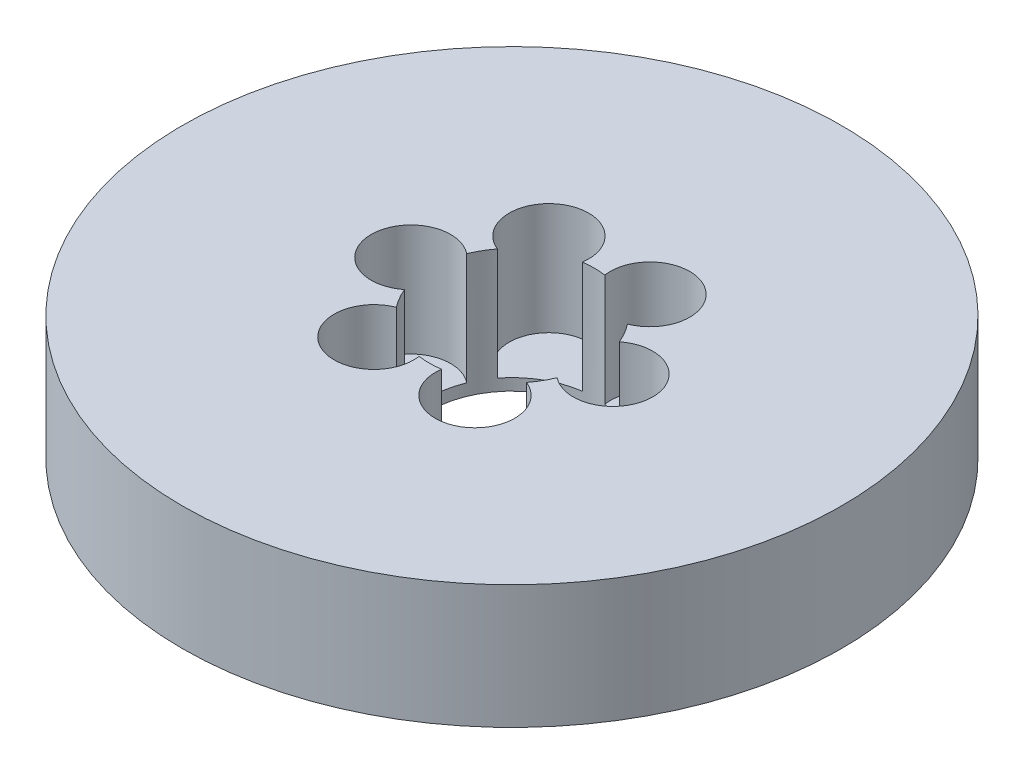
ISO-10303-21;
HEADER;
FILE_DESCRIPTION(('STEP AP214'),'2;1');
FILE_NAME('part.step','',(''),(''),'','','');
FILE_SCHEMA(('AUTOMOTIVE_DESIGN { 1 0 10303 214 1 1 1 1 }'));
ENDSEC;
DATA;
#1=APPLICATION_CONTEXT('core data for automotive mechanical design processes');
#2=APPLICATION_PROTOCOL_DEFINITION('international standard','automotive_design',2000,#1);
#3=PRODUCT_CONTEXT('',#1,'mechanical');
#4=PRODUCT('Part','Part','',(#3));
#5=PRODUCT_RELATED_PRODUCT_CATEGORY('part','',(#4));
#6=PRODUCT_DEFINITION_FORMATION('','',#4);
#7=PRODUCT_DEFINITION_CONTEXT('part definition',#1,'design');
#8=PRODUCT_DEFINITION('design','',#6,#7);
#9=PRODUCT_DEFINITION_SHAPE('','',#8);
#10=(LENGTH_UNIT() NAMED_UNIT(*) SI_UNIT(.MILLI.,.METRE.));
#11=(NAMED_UNIT(*) PLANE_ANGLE_UNIT() SI_UNIT($,.RADIAN.));
#12=(NAMED_UNIT(*) SI_UNIT($,.STERADIAN.) SOLID_ANGLE_UNIT());
#13=UNCERTAINTY_MEASURE_WITH_UNIT(LENGTH_MEASURE(1.E-05),#10,'distance_accuracy_value','');
#14=(GEOMETRIC_REPRESENTATION_CONTEXT(3) GLOBAL_UNCERTAINTY_ASSIGNED_CONTEXT((#13)) GLOBAL_UNIT_ASSIGNED_CONTEXT((#10,
#11,#12)) REPRESENTATION_CONTEXT('',''));
#15=CARTESIAN_POINT('',(0.,0.,0.));
#16=DIRECTION('',(0.,0.,1.));
#17=DIRECTION('',(1.,0.,0.));
#18=AXIS2_PLACEMENT_3D('',#15,#16,#17);
#19=CARTESIAN_POINT('',(0.,30.,0.));
#20=DIRECTION('',(0.,-1.,0.));
#21=DIRECTION('',(0.,0.,-1.));
#22=AXIS2_PLACEMENT_3D('',#19,#20,#21);
#23=CYLINDRICAL_SURFACE('',#22,80.);
#24=CARTESIAN_POINT('',(0.,30.,0.));
#25=DIRECTION('',(0.,1.,0.));
#26=DIRECTION('',(0.,0.,1.));
#27=AXIS2_PLACEMENT_3D('',#24,#25,#26);
#28=CIRCLE('',#27,80.);
#29=CARTESIAN_POINT('',(0.,30.,80.));
#30=VERTEX_POINT('',#29);
#31=EDGE_CURVE('E171',#30,#30,#28,.T.);
#32=ORIENTED_EDGE('',*,*,#31,.F.);
#33=EDGE_LOOP('',(#32));
#34=FACE_BOUND('',#33,.T.);
#35=CARTESIAN_POINT('',(0.,0.,0.));
#36=DIRECTION('',(0.,1.,0.));
#37=DIRECTION('',(0.,0.,1.));
#38=AXIS2_PLACEMENT_3D('',#35,#36,#37);
#39=CIRCLE('',#38,80.);
#40=CARTESIAN_POINT('',(0.,0.,80.));
#41=VERTEX_POINT('',#40);
#42=EDGE_CURVE('E157',#41,#41,#39,.T.);
#43=ORIENTED_EDGE('',*,*,#42,.T.);
#44=EDGE_LOOP('',(#43));
#45=FACE_BOUND('',#44,.T.);
#46=ADVANCED_FACE('F39',(#34,#45),#23,.T.);
#47=CARTESIAN_POINT('',(0.,30.,0.));
#48=DIRECTION('',(0.,1.,0.));
#49=DIRECTION('',(0.,0.,1.));
#50=AXIS2_PLACEMENT_3D('',#47,#48,#49);
#51=PLANE('',#50);
#52=CARTESIAN_POINT('',(-12.2628299238324,30.,-21.2398444726531));
#53=DIRECTION('',(0.,1.,0.));
#54=DIRECTION('',(-0.866025403784433,0.,0.50000000000001));
#55=AXIS2_PLACEMENT_3D('',#52,#53,#54);
#56=CIRCLE('',#55,9.64634296790213);
#57=CARTESIAN_POINT('',(-2.72247164071736,30.,-19.8138372902749));
#58=VERTEX_POINT('',#57);
#59=CARTESIAN_POINT('',(-15.7980506194711,30.,-12.264648247081));
#60=VERTEX_POINT('',#59);
#61=EDGE_CURVE('E214',#58,#60,#56,.T.);
#62=ORIENTED_EDGE('',*,*,#61,.F.);
#63=CARTESIAN_POINT('',(0.,30.,0.));
#64=DIRECTION('',(0.,1.,0.));
#65=DIRECTION('',(0.,0.,1.));
#66=AXIS2_PLACEMENT_3D('',#63,#64,#65);
#67=CIRCLE('',#66,20.);
#68=CARTESIAN_POINT('',(2.72247164071694,30.,-19.813837290275));
#69=VERTEX_POINT('',#68);
#70=EDGE_CURVE('E272',#69,#58,#67,.T.);
#71=ORIENTED_EDGE('',*,*,#70,.F.);
#72=CARTESIAN_POINT('',(12.2628299238319,30.,-21.2398444726533));
#73=DIRECTION('',(0.,1.,0.));
#74=DIRECTION('',(-0.866025403784443,0.,-0.499999999999992));
#75=AXIS2_PLACEMENT_3D('',#72,#73,#74);
#76=CIRCLE('',#75,9.64634296790213);
#77=CARTESIAN_POINT('',(15.7980506194709,30.,-12.2646482470814));
#78=VERTEX_POINT('',#77);
#79=EDGE_CURVE('E285',#78,#69,#76,.T.);
#80=ORIENTED_EDGE('',*,*,#79,.F.);
#81=CARTESIAN_POINT('',(18.5205222601881,30.,-7.54918904319375));
#82=VERTEX_POINT('',#81);
#83=EDGE_CURVE('E165',#82,#78,#67,.T.);
#84=ORIENTED_EDGE('',*,*,#83,.F.);
#85=CARTESIAN_POINT('',(24.5256598476642,30.,0.));
#86=DIRECTION('',(0.,1.,0.));
#87=DIRECTION('',(0.,0.,-1.));
#88=AXIS2_PLACEMENT_3D('',#85,#86,#87);
#89=CIRCLE('',#88,9.64634296790213);
#90=CARTESIAN_POINT('',(18.5205222601881,30.,7.54918904319375));
#91=VERTEX_POINT('',#90);
#92=EDGE_CURVE('E281',#91,#82,#89,.T.);
#93=ORIENTED_EDGE('',*,*,#92,.F.);
#94=CARTESIAN_POINT('',(15.798050619471,30.,12.2646482470811));
#95=VERTEX_POINT('',#94);
#96=EDGE_CURVE('E160',#95,#91,#67,.T.);
#97=ORIENTED_EDGE('',*,*,#96,.F.);
#98=CARTESIAN_POINT('',(12.2628299238322,30.,21.2398444726531));
#99=DIRECTION('',(0.,1.,0.));
#100=DIRECTION('',(0.866025403784436,0.,-0.500000000000004));
#101=AXIS2_PLACEMENT_3D('',#98,#99,#100);
#102=CIRCLE('',#101,9.64634296790213);
#103=CARTESIAN_POINT('',(2.72247164071722,30.,19.813837290275));
#104=VERTEX_POINT('',#103);
#105=EDGE_CURVE('E154',#104,#95,#102,.T.);
#106=ORIENTED_EDGE('',*,*,#105,.F.);
#107=CARTESIAN_POINT('',(-2.72247164071708,30.,19.813837290275));
#108=VERTEX_POINT('',#107);
#109=EDGE_CURVE('E150',#108,#104,#67,.T.);
#110=ORIENTED_EDGE('',*,*,#109,.F.);
#111=CARTESIAN_POINT('',(-12.2628299238321,30.,21.2398444726532));
#112=DIRECTION('',(0.,1.,0.));
#113=DIRECTION('',(0.86602540378444,0.,0.499999999999998));
#114=AXIS2_PLACEMENT_3D('',#111,#112,#113);
#115=CIRCLE('',#114,9.64634296790213);
#116=CARTESIAN_POINT('',(-15.798050619471,30.,12.2646482470813));
#117=VERTEX_POINT('',#116);
#118=EDGE_CURVE('E127',#117,#108,#115,.T.);
#119=ORIENTED_EDGE('',*,*,#118,.F.);
#120=CARTESIAN_POINT('',(-18.5205222601881,30.,7.54918904319375));
#121=VERTEX_POINT('',#120);
#122=EDGE_CURVE('E156',#121,#117,#67,.T.);
#123=ORIENTED_EDGE('',*,*,#122,.F.);
#124=CARTESIAN_POINT('',(-24.5256598476642,30.,0.));
#125=DIRECTION('',(0.,1.,0.));
#126=DIRECTION('',(0.,0.,1.));
#127=AXIS2_PLACEMENT_3D('',#124,#125,#126);
#128=CIRCLE('',#127,9.64634296790213);
#129=CARTESIAN_POINT('',(-18.5205222601881,30.,-7.54918904319375));
#130=VERTEX_POINT('',#129);
#131=EDGE_CURVE('E164',#130,#121,#128,.T.);
#132=ORIENTED_EDGE('',*,*,#131,.F.);
#133=EDGE_CURVE('E159',#60,#130,#67,.T.);
#134=ORIENTED_EDGE('',*,*,#133,.F.);
#135=EDGE_LOOP('',(#62,#71,#80,#84,#93,#97,#106,#110,#119,#123,#132,#134));
#136=FACE_BOUND('',#135,.T.);
#137=ORIENTED_EDGE('',*,*,#31,.T.);
#138=EDGE_LOOP('',(#137));
#139=FACE_BOUND('',#138,.T.);
#140=ADVANCED_FACE('F155',(#136,#139),#51,.T.);
#141=CARTESIAN_POINT('',(0.,0.,0.));
#142=DIRECTION('',(0.,1.,0.));
#143=DIRECTION('',(0.,0.,1.));
#144=AXIS2_PLACEMENT_3D('',#141,#142,#143);
#145=PLANE('',#144);
#146=CARTESIAN_POINT('',(0.,0.,0.));
#147=DIRECTION('',(0.,1.,0.));
#148=DIRECTION('',(0.,0.,1.));
#149=AXIS2_PLACEMENT_3D('',#146,#147,#148);
#150=CIRCLE('',#149,20.);
#151=CARTESIAN_POINT('',(0.,0.,20.));
#152=VERTEX_POINT('',#151);
#153=EDGE_CURVE('E170',#152,#152,#150,.T.);
#154=ORIENTED_EDGE('',*,*,#153,.T.);
#155=EDGE_LOOP('',(#154));
#156=FACE_BOUND('',#155,.T.);
#157=ORIENTED_EDGE('',*,*,#42,.F.);
#158=EDGE_LOOP('',(#157));
#159=FACE_BOUND('',#158,.T.);
#160=ADVANCED_FACE('F232',(#156,#159),#145,.F.);
#161=CARTESIAN_POINT('',(0.,30.,0.));
#162=DIRECTION('',(0.,-1.,0.));
#163=DIRECTION('',(0.,0.,-1.));
#164=AXIS2_PLACEMENT_3D('',#161,#162,#163);
#165=CYLINDRICAL_SURFACE('',#164,20.);
#166=DIRECTION('',(0.,1.,0.));
#167=VECTOR('',#166,1.);
#168=CARTESIAN_POINT('',(-2.72247164071736,16.4276454205517,-19.8138372902749));
#169=LINE('',#168,#167);
#170=CARTESIAN_POINT('',(-2.72247164071736,2.85529084110336,-19.8138372902749));
#171=VERTEX_POINT('',#170);
#172=EDGE_CURVE('E11',#171,#58,#169,.T.);
#173=ORIENTED_EDGE('',*,*,#172,.F.);
#174=CARTESIAN_POINT('',(0.,2.85529084110336,0.));
#175=DIRECTION('',(0.,1.,0.));
#176=DIRECTION('',(0.,0.,1.));
#177=AXIS2_PLACEMENT_3D('',#174,#175,#176);
#178=CIRCLE('',#177,20.);
#179=CARTESIAN_POINT('',(-15.7980506194711,2.85529084110336,-12.264648247081));
#180=VERTEX_POINT('',#179);
#181=EDGE_CURVE('E209',#171,#180,#178,.T.);
#182=ORIENTED_EDGE('',*,*,#181,.T.);
#183=DIRECTION('',(0.,1.,0.));
#184=VECTOR('',#183,1.);
#185=CARTESIAN_POINT('',(-15.7980506194711,16.4276454205517,-12.264648247081));
#186=LINE('',#185,#184);
#187=EDGE_CURVE('E46',#60,#180,#186,.F.);
#188=ORIENTED_EDGE('',*,*,#187,.F.);
#189=ORIENTED_EDGE('',*,*,#133,.T.);
#190=DIRECTION('',(0.,1.,0.));
#191=VECTOR('',#190,1.);
#192=CARTESIAN_POINT('',(-18.5205222601881,16.4276454205517,-7.54918904319375));
#193=LINE('',#192,#191);
#194=CARTESIAN_POINT('',(-18.5205222601881,2.85529084110336,-7.54918904319375));
#195=VERTEX_POINT('',#194);
#196=EDGE_CURVE('E185',#195,#130,#193,.T.);
#197=ORIENTED_EDGE('',*,*,#196,.F.);
#198=CARTESIAN_POINT('',(0.,2.85529084110336,0.));
#199=DIRECTION('',(0.,1.,0.));
#200=DIRECTION('',(0.,0.,1.));
#201=AXIS2_PLACEMENT_3D('',#198,#199,#200);
#202=CIRCLE('',#201,20.);
#203=CARTESIAN_POINT('',(-18.5205222601881,2.85529084110336,7.54918904319375));
#204=VERTEX_POINT('',#203);
#205=EDGE_CURVE('E173',#195,#204,#202,.T.);
#206=ORIENTED_EDGE('',*,*,#205,.T.);
#207=DIRECTION('',(0.,1.,0.));
#208=VECTOR('',#207,1.);
#209=CARTESIAN_POINT('',(-18.5205222601881,16.4276454205517,7.54918904319375));
#210=LINE('',#209,#208);
#211=EDGE_CURVE('E178',#121,#204,#210,.F.);
#212=ORIENTED_EDGE('',*,*,#211,.F.);
#213=ORIENTED_EDGE('',*,*,#122,.T.);
#214=DIRECTION('',(0.,1.,0.));
#215=VECTOR('',#214,1.);
#216=CARTESIAN_POINT('',(-15.798050619471,16.4276454205517,12.2646482470813));
#217=LINE('',#216,#215);
#218=CARTESIAN_POINT('',(-15.798050619471,2.85529084110336,12.2646482470813));
#219=VERTEX_POINT('',#218);
#220=EDGE_CURVE('E132',#219,#117,#217,.T.);
#221=ORIENTED_EDGE('',*,*,#220,.F.);
#222=CARTESIAN_POINT('',(0.,2.85529084110336,0.));
#223=DIRECTION('',(0.,1.,0.));
#224=DIRECTION('',(0.,0.,1.));
#225=AXIS2_PLACEMENT_3D('',#222,#223,#224);
#226=CIRCLE('',#225,20.);
#227=CARTESIAN_POINT('',(-2.72247164071708,2.85529084110336,19.813837290275));
#228=VERTEX_POINT('',#227);
#229=EDGE_CURVE('E146',#219,#228,#226,.T.);
#230=ORIENTED_EDGE('',*,*,#229,.T.);
#231=DIRECTION('',(0.,1.,0.));
#232=VECTOR('',#231,1.);
#233=CARTESIAN_POINT('',(-2.72247164071708,16.4276454205517,19.813837290275));
#234=LINE('',#233,#232);
#235=EDGE_CURVE('E128',#108,#228,#234,.F.);
#236=ORIENTED_EDGE('',*,*,#235,.F.);
#237=ORIENTED_EDGE('',*,*,#109,.T.);
#238=DIRECTION('',(0.,1.,0.));
#239=VECTOR('',#238,1.);
#240=CARTESIAN_POINT('',(2.72247164071722,16.4276454205517,19.813837290275));
#241=LINE('',#240,#239);
#242=CARTESIAN_POINT('',(2.72247164071722,2.85529084110336,19.813837290275));
#243=VERTEX_POINT('',#242);
#244=EDGE_CURVE('E192',#243,#104,#241,.T.);
#245=ORIENTED_EDGE('',*,*,#244,.F.);
#246=CARTESIAN_POINT('',(0.,2.85529084110336,0.));
#247=DIRECTION('',(0.,1.,0.));
#248=DIRECTION('',(0.,0.,1.));
#249=AXIS2_PLACEMENT_3D('',#246,#247,#248);
#250=CIRCLE('',#249,20.);
#251=CARTESIAN_POINT('',(15.798050619471,2.85529084110336,12.2646482470811));
#252=VERTEX_POINT('',#251);
#253=EDGE_CURVE('E190',#243,#252,#250,.T.);
#254=ORIENTED_EDGE('',*,*,#253,.T.);
#255=DIRECTION('',(0.,1.,0.));
#256=VECTOR('',#255,1.);
#257=CARTESIAN_POINT('',(15.798050619471,16.4276454205517,12.2646482470811));
#258=LINE('',#257,#256);
#259=EDGE_CURVE('E189',#95,#252,#258,.F.);
#260=ORIENTED_EDGE('',*,*,#259,.F.);
#261=ORIENTED_EDGE('',*,*,#96,.T.);
#262=DIRECTION('',(0.,1.,0.));
#263=VECTOR('',#262,1.);
#264=CARTESIAN_POINT('',(18.5205222601881,16.4276454205517,7.54918904319375));
#265=LINE('',#264,#263);
#266=CARTESIAN_POINT('',(18.5205222601881,2.85529084110336,7.54918904319375));
#267=VERTEX_POINT('',#266);
#268=EDGE_CURVE('E203',#267,#91,#265,.T.);
#269=ORIENTED_EDGE('',*,*,#268,.F.);
#270=CARTESIAN_POINT('',(0.,2.85529084110336,0.));
#271=DIRECTION('',(0.,1.,0.));
#272=DIRECTION('',(0.,0.,1.));
#273=AXIS2_PLACEMENT_3D('',#270,#271,#272);
#274=CIRCLE('',#273,20.);
#275=CARTESIAN_POINT('',(18.5205222601881,2.85529084110336,-7.54918904319375));
#276=VERTEX_POINT('',#275);
#277=EDGE_CURVE('E194',#267,#276,#274,.T.);
#278=ORIENTED_EDGE('',*,*,#277,.T.);
#279=DIRECTION('',(0.,1.,0.));
#280=VECTOR('',#279,1.);
#281=CARTESIAN_POINT('',(18.5205222601881,16.4276454205517,-7.54918904319375));
#282=LINE('',#281,#280);
#283=EDGE_CURVE('E196',#82,#276,#282,.F.);
#284=ORIENTED_EDGE('',*,*,#283,.F.);
#285=ORIENTED_EDGE('',*,*,#83,.T.);
#286=DIRECTION('',(0.,1.,0.));
#287=VECTOR('',#286,1.);
#288=CARTESIAN_POINT('',(15.7980506194709,16.4276454205517,-12.2646482470814));
#289=LINE('',#288,#287);
#290=CARTESIAN_POINT('',(15.7980506194709,2.85529084110336,-12.2646482470814));
#291=VERTEX_POINT('',#290);
#292=EDGE_CURVE('E208',#291,#78,#289,.T.);
#293=ORIENTED_EDGE('',*,*,#292,.F.);
#294=CARTESIAN_POINT('',(0.,2.85529084110336,0.));
#295=DIRECTION('',(0.,1.,0.));
#296=DIRECTION('',(0.,0.,1.));
#297=AXIS2_PLACEMENT_3D('',#294,#295,#296);
#298=CIRCLE('',#297,20.);
#299=CARTESIAN_POINT('',(2.72247164071694,2.85529084110336,-19.813837290275));
#300=VERTEX_POINT('',#299);
#301=EDGE_CURVE('E201',#291,#300,#298,.T.);
#302=ORIENTED_EDGE('',*,*,#301,.T.);
#303=DIRECTION('',(0.,1.,0.));
#304=VECTOR('',#303,1.);
#305=CARTESIAN_POINT('',(2.72247164071694,16.4276454205517,-19.813837290275));
#306=LINE('',#305,#304);
#307=EDGE_CURVE('E206',#69,#300,#306,.F.);
#308=ORIENTED_EDGE('',*,*,#307,.F.);
#309=ORIENTED_EDGE('',*,*,#70,.T.);
#310=EDGE_LOOP('',(#173,#182,#188,#189,#197,#206,#212,#213,#221,#230,#236,#237,#245,#254,#260,
#261,#269,#278,#284,#285,#293,#302,#308,#309));
#311=FACE_BOUND('',#310,.T.);
#312=ORIENTED_EDGE('',*,*,#153,.F.);
#313=EDGE_LOOP('',(#312));
#314=FACE_BOUND('',#313,.T.);
#315=ADVANCED_FACE('F145',(#311,#314),#165,.F.);
#316=CARTESIAN_POINT('',(-24.5256598476642,2.85529084110336,0.));
#317=DIRECTION('',(0.,1.,0.));
#318=DIRECTION('',(0.,0.,1.));
#319=AXIS2_PLACEMENT_3D('',#316,#317,#318);
#320=CYLINDRICAL_SURFACE('',#319,9.64634296790213);
#321=ORIENTED_EDGE('',*,*,#196,.T.);
#322=ORIENTED_EDGE('',*,*,#131,.T.);
#323=ORIENTED_EDGE('',*,*,#211,.T.);
#324=CARTESIAN_POINT('',(-24.5256598476642,2.85529084110336,0.));
#325=DIRECTION('',(0.,1.,0.));
#326=DIRECTION('',(0.,0.,1.));
#327=AXIS2_PLACEMENT_3D('',#324,#325,#326);
#328=CIRCLE('',#327,9.64634296790213);
#329=EDGE_CURVE('E168',#195,#204,#328,.T.);
#330=ORIENTED_EDGE('',*,*,#329,.F.);
#331=EDGE_LOOP('',(#321,#322,#323,#330));
#332=FACE_BOUND('',#331,.T.);
#333=ADVANCED_FACE('F243',(#332),#320,.F.);
#334=CARTESIAN_POINT('',(-24.5256598476642,2.85529084110336,0.));
#335=DIRECTION('',(0.,1.,0.));
#336=DIRECTION('',(0.,0.,1.));
#337=AXIS2_PLACEMENT_3D('',#334,#335,#336);
#338=PLANE('',#337);
#339=ORIENTED_EDGE('',*,*,#329,.T.);
#340=ORIENTED_EDGE('',*,*,#205,.F.);
#341=EDGE_LOOP('',(#339,#340));
#342=FACE_BOUND('',#341,.T.);
#343=ADVANCED_FACE('F247',(#342),#338,.T.);
#344=CARTESIAN_POINT('',(-12.2628299238321,2.85529084110336,21.2398444726532));
#345=DIRECTION('',(0.,1.,0.));
#346=DIRECTION('',(0.,0.,1.));
#347=AXIS2_PLACEMENT_3D('',#344,#345,#346);
#348=CYLINDRICAL_SURFACE('',#347,9.64634296790213);
#349=ORIENTED_EDGE('',*,*,#220,.T.);
#350=ORIENTED_EDGE('',*,*,#118,.T.);
#351=ORIENTED_EDGE('',*,*,#235,.T.);
#352=CARTESIAN_POINT('',(-12.2628299238321,2.85529084110336,21.2398444726532));
#353=DIRECTION('',(0.,1.,0.));
#354=DIRECTION('',(0.86602540378444,0.,0.499999999999998));
#355=AXIS2_PLACEMENT_3D('',#352,#353,#354);
#356=CIRCLE('',#355,9.64634296790213);
#357=EDGE_CURVE('E137',#219,#228,#356,.T.);
#358=ORIENTED_EDGE('',*,*,#357,.F.);
#359=EDGE_LOOP('',(#349,#350,#351,#358));
#360=FACE_BOUND('',#359,.T.);
#361=ADVANCED_FACE('F126',(#360),#348,.F.);
#362=CARTESIAN_POINT('',(-12.2628299238321,2.85529084110336,21.2398444726532));
#363=DIRECTION('',(0.,1.,0.));
#364=DIRECTION('',(0.86602540378444,0.,0.499999999999998));
#365=AXIS2_PLACEMENT_3D('',#362,#363,#364);
#366=PLANE('',#365);
#367=ORIENTED_EDGE('',*,*,#357,.T.);
#368=ORIENTED_EDGE('',*,*,#229,.F.);
#369=EDGE_LOOP('',(#367,#368));
#370=FACE_BOUND('',#369,.T.);
#371=ADVANCED_FACE('F254',(#370),#366,.T.);
#372=CARTESIAN_POINT('',(12.2628299238322,2.85529084110336,21.2398444726531));
#373=DIRECTION('',(0.,1.,0.));
#374=DIRECTION('',(0.,0.,1.));
#375=AXIS2_PLACEMENT_3D('',#372,#373,#374);
#376=CYLINDRICAL_SURFACE('',#375,9.64634296790213);
#377=ORIENTED_EDGE('',*,*,#244,.T.);
#378=ORIENTED_EDGE('',*,*,#105,.T.);
#379=ORIENTED_EDGE('',*,*,#259,.T.);
#380=CARTESIAN_POINT('',(12.2628299238322,2.85529084110336,21.2398444726531));
#381=DIRECTION('',(0.,1.,0.));
#382=DIRECTION('',(0.866025403784436,0.,-0.500000000000004));
#383=AXIS2_PLACEMENT_3D('',#380,#381,#382);
#384=CIRCLE('',#383,9.64634296790213);
#385=EDGE_CURVE('E138',#243,#252,#384,.T.);
#386=ORIENTED_EDGE('',*,*,#385,.F.);
#387=EDGE_LOOP('',(#377,#378,#379,#386));
#388=FACE_BOUND('',#387,.T.);
#389=ADVANCED_FACE('F260',(#388),#376,.F.);
#390=CARTESIAN_POINT('',(12.2628299238322,2.85529084110336,21.2398444726531));
#391=DIRECTION('',(0.,1.,0.));
#392=DIRECTION('',(0.866025403784436,0.,-0.500000000000004));
#393=AXIS2_PLACEMENT_3D('',#390,#391,#392);
#394=PLANE('',#393);
#395=ORIENTED_EDGE('',*,*,#385,.T.);
#396=ORIENTED_EDGE('',*,*,#253,.F.);
#397=EDGE_LOOP('',(#395,#396));
#398=FACE_BOUND('',#397,.T.);
#399=ADVANCED_FACE('F265',(#398),#394,.T.);
#400=CARTESIAN_POINT('',(24.5256598476642,2.85529084110336,0.));
#401=DIRECTION('',(0.,1.,0.));
#402=DIRECTION('',(0.,0.,1.));
#403=AXIS2_PLACEMENT_3D('',#400,#401,#402);
#404=CYLINDRICAL_SURFACE('',#403,9.64634296790213);
#405=ORIENTED_EDGE('',*,*,#268,.T.);
#406=ORIENTED_EDGE('',*,*,#92,.T.);
#407=ORIENTED_EDGE('',*,*,#283,.T.);
#408=CARTESIAN_POINT('',(24.5256598476642,2.85529084110336,0.));
#409=DIRECTION('',(0.,1.,0.));
#410=DIRECTION('',(0.,0.,-1.));
#411=AXIS2_PLACEMENT_3D('',#408,#409,#410);
#412=CIRCLE('',#411,9.64634296790213);
#413=EDGE_CURVE('E287',#267,#276,#412,.T.);
#414=ORIENTED_EDGE('',*,*,#413,.F.);
#415=EDGE_LOOP('',(#405,#406,#407,#414));
#416=FACE_BOUND('',#415,.T.);
#417=ADVANCED_FACE('F300',(#416),#404,.F.);
#418=CARTESIAN_POINT('',(24.5256598476642,2.85529084110336,0.));
#419=DIRECTION('',(0.,1.,0.));
#420=DIRECTION('',(0.,0.,-1.));
#421=AXIS2_PLACEMENT_3D('',#418,#419,#420);
#422=PLANE('',#421);
#423=ORIENTED_EDGE('',*,*,#413,.T.);
#424=ORIENTED_EDGE('',*,*,#277,.F.);
#425=EDGE_LOOP('',(#423,#424));
#426=FACE_BOUND('',#425,.T.);
#427=ADVANCED_FACE('F298',(#426),#422,.T.);
#428=CARTESIAN_POINT('',(12.2628299238319,2.85529084110336,-21.2398444726533));
#429=DIRECTION('',(0.,1.,0.));
#430=DIRECTION('',(0.,0.,1.));
#431=AXIS2_PLACEMENT_3D('',#428,#429,#430);
#432=CYLINDRICAL_SURFACE('',#431,9.64634296790213);
#433=ORIENTED_EDGE('',*,*,#292,.T.);
#434=ORIENTED_EDGE('',*,*,#79,.T.);
#435=ORIENTED_EDGE('',*,*,#307,.T.);
#436=CARTESIAN_POINT('',(12.2628299238319,2.85529084110336,-21.2398444726533));
#437=DIRECTION('',(0.,1.,0.));
#438=DIRECTION('',(-0.866025403784443,0.,-0.499999999999992));
#439=AXIS2_PLACEMENT_3D('',#436,#437,#438);
#440=CIRCLE('',#439,9.64634296790213);
#441=EDGE_CURVE('E56',#291,#300,#440,.T.);
#442=ORIENTED_EDGE('',*,*,#441,.F.);
#443=EDGE_LOOP('',(#433,#434,#435,#442));
#444=FACE_BOUND('',#443,.T.);
#445=ADVANCED_FACE('F301',(#444),#432,.F.);
#446=CARTESIAN_POINT('',(12.2628299238319,2.85529084110336,-21.2398444726533));
#447=DIRECTION('',(0.,1.,0.));
#448=DIRECTION('',(-0.866025403784443,0.,-0.499999999999992));
#449=AXIS2_PLACEMENT_3D('',#446,#447,#448);
#450=PLANE('',#449);
#451=ORIENTED_EDGE('',*,*,#441,.T.);
#452=ORIENTED_EDGE('',*,*,#301,.F.);
#453=EDGE_LOOP('',(#451,#452));
#454=FACE_BOUND('',#453,.T.);
#455=ADVANCED_FACE('F221',(#454),#450,.T.);
#456=CARTESIAN_POINT('',(-12.2628299238324,2.85529084110336,-21.2398444726531));
#457=DIRECTION('',(0.,1.,0.));
#458=DIRECTION('',(0.,0.,1.));
#459=AXIS2_PLACEMENT_3D('',#456,#457,#458);
#460=CYLINDRICAL_SURFACE('',#459,9.64634296790213);
#461=ORIENTED_EDGE('',*,*,#172,.T.);
#462=ORIENTED_EDGE('',*,*,#61,.T.);
#463=ORIENTED_EDGE('',*,*,#187,.T.);
#464=CARTESIAN_POINT('',(-12.2628299238324,2.85529084110336,-21.2398444726531));
#465=DIRECTION('',(0.,1.,0.));
#466=DIRECTION('',(-0.866025403784433,0.,0.50000000000001));
#467=AXIS2_PLACEMENT_3D('',#464,#465,#466);
#468=CIRCLE('',#467,9.64634296790213);
#469=EDGE_CURVE('E55',#171,#180,#468,.T.);
#470=ORIENTED_EDGE('',*,*,#469,.F.);
#471=EDGE_LOOP('',(#461,#462,#463,#470));
#472=FACE_BOUND('',#471,.T.);
#473=ADVANCED_FACE('F212',(#472),#460,.F.);
#474=CARTESIAN_POINT('',(-12.2628299238324,2.85529084110336,-21.2398444726531));
#475=DIRECTION('',(0.,1.,0.));
#476=DIRECTION('',(-0.866025403784433,0.,0.50000000000001));
#477=AXIS2_PLACEMENT_3D('',#474,#475,#476);
#478=PLANE('',#477);
#479=ORIENTED_EDGE('',*,*,#469,.T.);
#480=ORIENTED_EDGE('',*,*,#181,.F.);
#481=EDGE_LOOP('',(#479,#480));
#482=FACE_BOUND('',#481,.T.);
#483=ADVANCED_FACE('F217',(#482),#478,.T.);
#484=CLOSED_SHELL('',(#46,#140,#160,#315,#333,#343,#361,#371,#389,#399,#417,#427,#445,#455,#473,#483));
#485=MANIFOLD_SOLID_BREP('B2',#484);
#486=ADVANCED_BREP_SHAPE_REPRESENTATION('',(#18,#485),#14);
#487=SHAPE_DEFINITION_REPRESENTATION(#9,#486);
ENDSEC;
END-ISO-10303-21;
